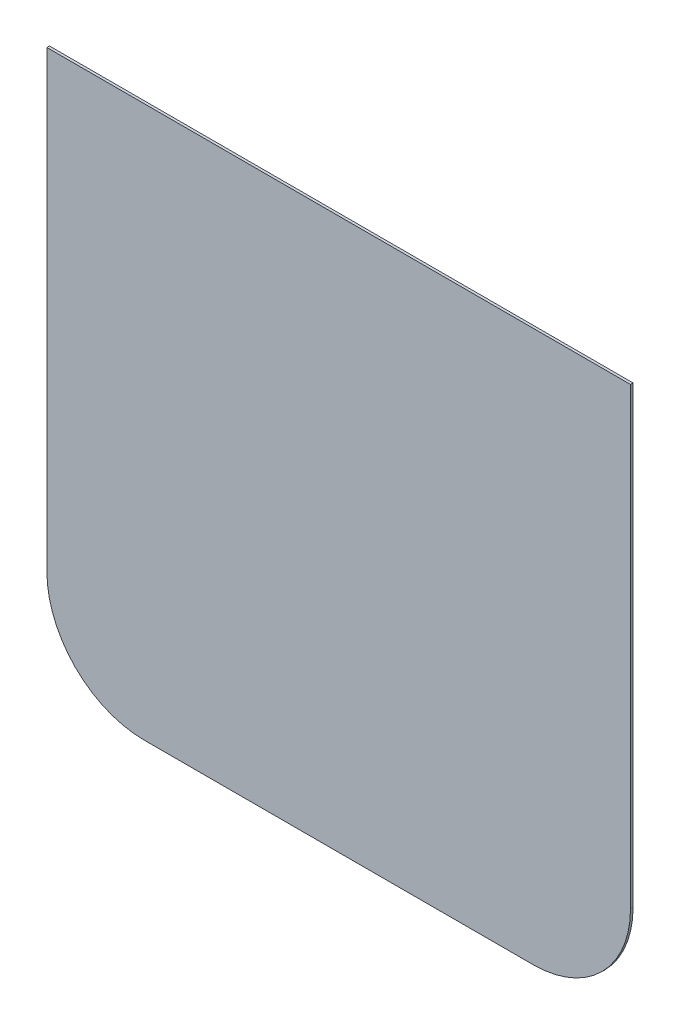
ISO-10303-21;
HEADER;
FILE_DESCRIPTION(('STEP AP214'),'2;1');
FILE_NAME('part.step','',(''),(''),'','','');
FILE_SCHEMA(('AUTOMOTIVE_DESIGN { 1 0 10303 214 1 1 1 1 }'));
ENDSEC;
DATA;
#1=APPLICATION_CONTEXT('core data for automotive mechanical design processes');
#2=APPLICATION_PROTOCOL_DEFINITION('international standard','automotive_design',2000,#1);
#3=PRODUCT_CONTEXT('',#1,'mechanical');
#4=PRODUCT('Part','Part','',(#3));
#5=PRODUCT_RELATED_PRODUCT_CATEGORY('part','',(#4));
#6=PRODUCT_DEFINITION_FORMATION('','',#4);
#7=PRODUCT_DEFINITION_CONTEXT('part definition',#1,'design');
#8=PRODUCT_DEFINITION('design','',#6,#7);
#9=PRODUCT_DEFINITION_SHAPE('','',#8);
#10=(LENGTH_UNIT() NAMED_UNIT(*) SI_UNIT(.MILLI.,.METRE.));
#11=(NAMED_UNIT(*) PLANE_ANGLE_UNIT() SI_UNIT($,.RADIAN.));
#12=(NAMED_UNIT(*) SI_UNIT($,.STERADIAN.) SOLID_ANGLE_UNIT());
#13=UNCERTAINTY_MEASURE_WITH_UNIT(LENGTH_MEASURE(1.E-05),#10,'distance_accuracy_value','');
#14=(GEOMETRIC_REPRESENTATION_CONTEXT(3) GLOBAL_UNCERTAINTY_ASSIGNED_CONTEXT((#13)) GLOBAL_UNIT_ASSIGNED_CONTEXT((#10,
#11,#12)) REPRESENTATION_CONTEXT('',''));
#15=CARTESIAN_POINT('',(0.,0.,0.));
#16=DIRECTION('',(0.,0.,1.));
#17=DIRECTION('',(1.,0.,0.));
#18=AXIS2_PLACEMENT_3D('',#15,#16,#17);
#19=CARTESIAN_POINT('',(-260.935972770029,123.115577889447,2.));
#20=DIRECTION('',(0.,-1.,0.));
#21=DIRECTION('',(0.,0.,-1.));
#22=AXIS2_PLACEMENT_3D('',#19,#20,#21);
#23=PLANE('',#22);
#24=DIRECTION('',(-1.,0.,0.));
#25=VECTOR('',#24,1.);
#26=CARTESIAN_POINT('',(-260.935972770029,123.115577889447,0.));
#27=LINE('',#26,#25);
#28=CARTESIAN_POINT('',(189.064027229971,123.115577889447,0.));
#29=VERTEX_POINT('',#28);
#30=CARTESIAN_POINT('',(-260.935972770029,123.115577889447,0.));
#31=VERTEX_POINT('',#30);
#32=EDGE_CURVE('E79',#29,#31,#27,.T.);
#33=ORIENTED_EDGE('',*,*,#32,.T.);
#34=DIRECTION('',(0.,0.,-1.));
#35=VECTOR('',#34,1.);
#36=CARTESIAN_POINT('',(-260.935972770029,123.115577889447,2.));
#37=LINE('',#36,#35);
#38=CARTESIAN_POINT('',(-260.935972770029,123.115577889447,2.));
#39=VERTEX_POINT('',#38);
#40=EDGE_CURVE('E11',#39,#31,#37,.T.);
#41=ORIENTED_EDGE('',*,*,#40,.F.);
#42=DIRECTION('',(-1.,0.,0.));
#43=VECTOR('',#42,1.);
#44=CARTESIAN_POINT('',(164.064027229971,123.115577889447,2.));
#45=LINE('',#44,#43);
#46=CARTESIAN_POINT('',(189.064027229971,123.115577889447,2.));
#47=VERTEX_POINT('',#46);
#48=EDGE_CURVE('E85',#47,#39,#45,.T.);
#49=ORIENTED_EDGE('',*,*,#48,.F.);
#50=DIRECTION('',(0.,0.,-1.));
#51=VECTOR('',#50,1.);
#52=CARTESIAN_POINT('',(189.064027229971,123.115577889447,2.));
#53=LINE('',#52,#51);
#54=EDGE_CURVE('E113',#47,#29,#53,.T.);
#55=ORIENTED_EDGE('',*,*,#54,.T.);
#56=EDGE_LOOP('',(#33,#41,#49,#55));
#57=FACE_BOUND('',#56,.T.);
#58=ADVANCED_FACE('F33',(#57),#23,.F.);
#59=CARTESIAN_POINT('',(-260.935972770029,123.115577889447,2.));
#60=DIRECTION('',(1.,0.,0.));
#61=DIRECTION('',(0.,0.,-1.));
#62=AXIS2_PLACEMENT_3D('',#59,#60,#61);
#63=PLANE('',#62);
#64=DIRECTION('',(0.,-1.,0.));
#65=VECTOR('',#64,1.);
#66=CARTESIAN_POINT('',(-260.935972770029,123.115577889447,0.));
#67=LINE('',#66,#65);
#68=CARTESIAN_POINT('',(-260.935972770029,-226.884422110552,0.));
#69=VERTEX_POINT('',#68);
#70=EDGE_CURVE('E118',#31,#69,#67,.T.);
#71=ORIENTED_EDGE('',*,*,#70,.T.);
#72=DIRECTION('',(0.,0.,-1.));
#73=VECTOR('',#72,1.);
#74=CARTESIAN_POINT('',(-260.935972770029,-226.884422110552,2.));
#75=LINE('',#74,#73);
#76=CARTESIAN_POINT('',(-260.935972770029,-226.884422110552,2.));
#77=VERTEX_POINT('',#76);
#78=EDGE_CURVE('E41',#77,#69,#75,.T.);
#79=ORIENTED_EDGE('',*,*,#78,.F.);
#80=DIRECTION('',(0.,-1.,0.));
#81=VECTOR('',#80,1.);
#82=CARTESIAN_POINT('',(-260.935972770029,123.115577889447,2.));
#83=LINE('',#82,#81);
#84=EDGE_CURVE('E140',#39,#77,#83,.T.);
#85=ORIENTED_EDGE('',*,*,#84,.F.);
#86=ORIENTED_EDGE('',*,*,#40,.T.);
#87=EDGE_LOOP('',(#71,#79,#85,#86));
#88=FACE_BOUND('',#87,.T.);
#89=ADVANCED_FACE('F143',(#88),#63,.F.);
#90=CARTESIAN_POINT('',(-185.935972770029,-226.884422110553,2.));
#91=DIRECTION('',(0.,0.,-1.));
#92=DIRECTION('',(-1.,0.,0.));
#93=AXIS2_PLACEMENT_3D('',#90,#91,#92);
#94=CYLINDRICAL_SURFACE('',#93,75.);
#95=CARTESIAN_POINT('',(-185.935972770029,-226.884422110553,0.));
#96=DIRECTION('',(0.,0.,1.));
#97=DIRECTION('',(1.,0.,0.));
#98=AXIS2_PLACEMENT_3D('',#95,#96,#97);
#99=CIRCLE('',#98,75.);
#100=CARTESIAN_POINT('',(-185.935972770028,-301.884422110553,0.));
#101=VERTEX_POINT('',#100);
#102=EDGE_CURVE('E120',#69,#101,#99,.T.);
#103=ORIENTED_EDGE('',*,*,#102,.T.);
#104=DIRECTION('',(0.,0.,-1.));
#105=VECTOR('',#104,1.);
#106=CARTESIAN_POINT('',(-185.935972770028,-301.884422110553,2.));
#107=LINE('',#106,#105);
#108=CARTESIAN_POINT('',(-185.935972770028,-301.884422110553,2.));
#109=VERTEX_POINT('',#108);
#110=EDGE_CURVE('E108',#109,#101,#107,.T.);
#111=ORIENTED_EDGE('',*,*,#110,.F.);
#112=CARTESIAN_POINT('',(-185.935972770029,-226.884422110553,2.));
#113=DIRECTION('',(0.,0.,1.));
#114=DIRECTION('',(1.,0.,0.));
#115=AXIS2_PLACEMENT_3D('',#112,#113,#114);
#116=CIRCLE('',#115,75.);
#117=EDGE_CURVE('E99',#77,#109,#116,.T.);
#118=ORIENTED_EDGE('',*,*,#117,.F.);
#119=ORIENTED_EDGE('',*,*,#78,.T.);
#120=EDGE_LOOP('',(#103,#111,#118,#119));
#121=FACE_BOUND('',#120,.T.);
#122=ADVANCED_FACE('F133',(#121),#94,.T.);
#123=CARTESIAN_POINT('',(-185.935972770028,-301.884422110553,2.));
#124=DIRECTION('',(0.,1.,0.));
#125=DIRECTION('',(0.,0.,1.));
#126=AXIS2_PLACEMENT_3D('',#123,#124,#125);
#127=PLANE('',#126);
#128=DIRECTION('',(1.,0.,0.));
#129=VECTOR('',#128,1.);
#130=CARTESIAN_POINT('',(-185.935972770028,-301.884422110553,0.));
#131=LINE('',#130,#129);
#132=CARTESIAN_POINT('',(114.064027229971,-301.884422110553,0.));
#133=VERTEX_POINT('',#132);
#134=EDGE_CURVE('E107',#101,#133,#131,.T.);
#135=ORIENTED_EDGE('',*,*,#134,.T.);
#136=DIRECTION('',(0.,0.,-1.));
#137=VECTOR('',#136,1.);
#138=CARTESIAN_POINT('',(114.064027229971,-301.884422110553,2.));
#139=LINE('',#138,#137);
#140=CARTESIAN_POINT('',(114.064027229971,-301.884422110553,2.));
#141=VERTEX_POINT('',#140);
#142=EDGE_CURVE('E104',#141,#133,#139,.T.);
#143=ORIENTED_EDGE('',*,*,#142,.F.);
#144=DIRECTION('',(1.,0.,0.));
#145=VECTOR('',#144,1.);
#146=CARTESIAN_POINT('',(-185.935972770028,-301.884422110553,2.));
#147=LINE('',#146,#145);
#148=EDGE_CURVE('E93',#109,#141,#147,.T.);
#149=ORIENTED_EDGE('',*,*,#148,.F.);
#150=ORIENTED_EDGE('',*,*,#110,.T.);
#151=EDGE_LOOP('',(#135,#143,#149,#150));
#152=FACE_BOUND('',#151,.T.);
#153=ADVANCED_FACE('F105',(#152),#127,.F.);
#154=CARTESIAN_POINT('',(114.064027229971,-226.884422110553,2.));
#155=DIRECTION('',(0.,0.,-1.));
#156=DIRECTION('',(-1.,0.,0.));
#157=AXIS2_PLACEMENT_3D('',#154,#155,#156);
#158=CYLINDRICAL_SURFACE('',#157,75.);
#159=CARTESIAN_POINT('',(114.064027229971,-226.884422110553,0.));
#160=DIRECTION('',(0.,0.,1.));
#161=DIRECTION('',(1.,0.,0.));
#162=AXIS2_PLACEMENT_3D('',#159,#160,#161);
#163=CIRCLE('',#162,75.);
#164=CARTESIAN_POINT('',(189.064027229971,-226.884422110553,0.));
#165=VERTEX_POINT('',#164);
#166=EDGE_CURVE('E72',#133,#165,#163,.T.);
#167=ORIENTED_EDGE('',*,*,#166,.T.);
#168=DIRECTION('',(0.,0.,-1.));
#169=VECTOR('',#168,1.);
#170=CARTESIAN_POINT('',(189.064027229971,-226.884422110553,2.));
#171=LINE('',#170,#169);
#172=CARTESIAN_POINT('',(189.064027229971,-226.884422110553,2.));
#173=VERTEX_POINT('',#172);
#174=EDGE_CURVE('E109',#173,#165,#171,.T.);
#175=ORIENTED_EDGE('',*,*,#174,.F.);
#176=CARTESIAN_POINT('',(114.064027229971,-226.884422110553,2.));
#177=DIRECTION('',(0.,0.,1.));
#178=DIRECTION('',(1.,0.,0.));
#179=AXIS2_PLACEMENT_3D('',#176,#177,#178);
#180=CIRCLE('',#179,75.);
#181=EDGE_CURVE('E97',#141,#173,#180,.T.);
#182=ORIENTED_EDGE('',*,*,#181,.F.);
#183=ORIENTED_EDGE('',*,*,#142,.T.);
#184=EDGE_LOOP('',(#167,#175,#182,#183));
#185=FACE_BOUND('',#184,.T.);
#186=ADVANCED_FACE('F111',(#185),#158,.T.);
#187=CARTESIAN_POINT('',(189.064027229971,123.115577889447,2.));
#188=DIRECTION('',(-1.,0.,0.));
#189=DIRECTION('',(0.,-1.,0.));
#190=AXIS2_PLACEMENT_3D('',#187,#188,#189);
#191=PLANE('',#190);
#192=DIRECTION('',(0.,1.,0.));
#193=VECTOR('',#192,1.);
#194=CARTESIAN_POINT('',(189.064027229971,123.115577889447,0.));
#195=LINE('',#194,#193);
#196=EDGE_CURVE('E124',#165,#29,#195,.T.);
#197=ORIENTED_EDGE('',*,*,#196,.T.);
#198=ORIENTED_EDGE('',*,*,#54,.F.);
#199=DIRECTION('',(0.,1.,0.));
#200=VECTOR('',#199,1.);
#201=CARTESIAN_POINT('',(189.064027229971,123.115577889447,2.));
#202=LINE('',#201,#200);
#203=EDGE_CURVE('E49',#173,#47,#202,.T.);
#204=ORIENTED_EDGE('',*,*,#203,.F.);
#205=ORIENTED_EDGE('',*,*,#174,.T.);
#206=EDGE_LOOP('',(#197,#198,#204,#205));
#207=FACE_BOUND('',#206,.T.);
#208=ADVANCED_FACE('F138',(#207),#191,.F.);
#209=CARTESIAN_POINT('',(114.064027229971,-226.884422110553,2.));
#210=DIRECTION('',(0.,0.,1.));
#211=DIRECTION('',(1.,0.,0.));
#212=AXIS2_PLACEMENT_3D('',#209,#210,#211);
#213=PLANE('',#212);
#214=ORIENTED_EDGE('',*,*,#48,.T.);
#215=ORIENTED_EDGE('',*,*,#84,.T.);
#216=ORIENTED_EDGE('',*,*,#117,.T.);
#217=ORIENTED_EDGE('',*,*,#148,.T.);
#218=ORIENTED_EDGE('',*,*,#181,.T.);
#219=ORIENTED_EDGE('',*,*,#203,.T.);
#220=EDGE_LOOP('',(#214,#215,#216,#217,#218,#219));
#221=FACE_BOUND('',#220,.T.);
#222=ADVANCED_FACE('F95',(#221),#213,.T.);
#223=CARTESIAN_POINT('',(114.064027229971,-226.884422110553,0.));
#224=DIRECTION('',(0.,0.,1.));
#225=DIRECTION('',(1.,0.,0.));
#226=AXIS2_PLACEMENT_3D('',#223,#224,#225);
#227=PLANE('',#226);
#228=ORIENTED_EDGE('',*,*,#32,.F.);
#229=ORIENTED_EDGE('',*,*,#196,.F.);
#230=ORIENTED_EDGE('',*,*,#166,.F.);
#231=ORIENTED_EDGE('',*,*,#134,.F.);
#232=ORIENTED_EDGE('',*,*,#102,.F.);
#233=ORIENTED_EDGE('',*,*,#70,.F.);
#234=EDGE_LOOP('',(#228,#229,#230,#231,#232,#233));
#235=FACE_BOUND('',#234,.T.);
#236=ADVANCED_FACE('F136',(#235),#227,.F.);
#237=CLOSED_SHELL('',(#58,#89,#122,#153,#186,#208,#222,#236));
#238=MANIFOLD_SOLID_BREP('B2',#237);
#239=ADVANCED_BREP_SHAPE_REPRESENTATION('',(#18,#238),#14);
#240=SHAPE_DEFINITION_REPRESENTATION(#9,#239);
ENDSEC;
END-ISO-10303-21;
